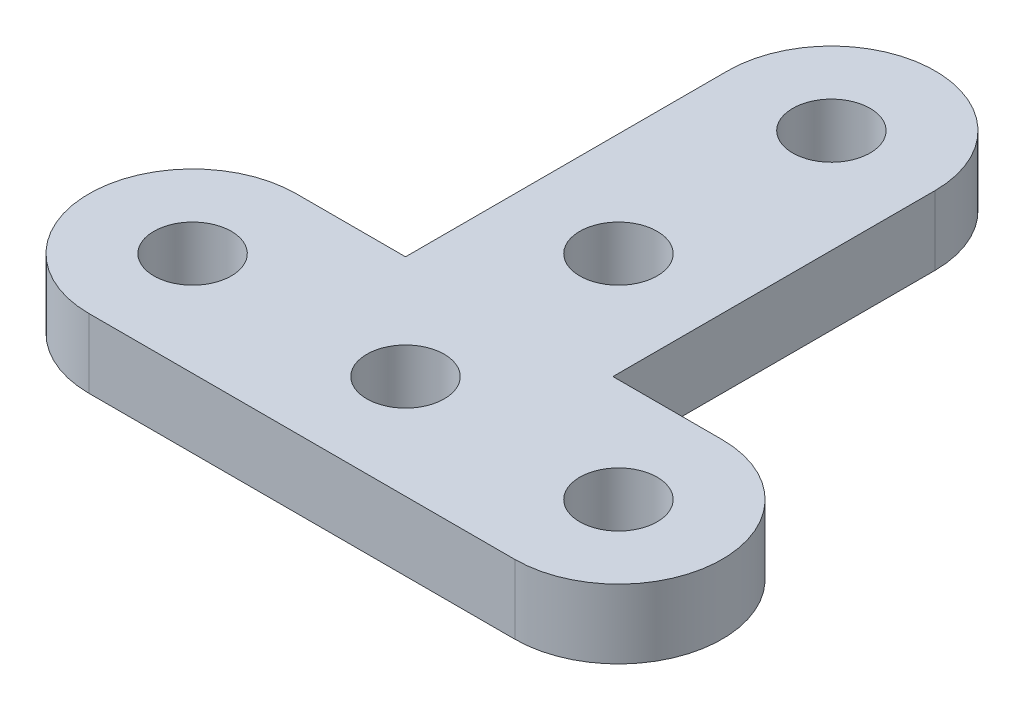
ISO-10303-21;
HEADER;
FILE_DESCRIPTION(('STEP AP214'),'2;1');
FILE_NAME('part.step','',(''),(''),'','','');
FILE_SCHEMA(('AUTOMOTIVE_DESIGN { 1 0 10303 214 1 1 1 1 }'));
ENDSEC;
DATA;
#1=APPLICATION_CONTEXT('core data for automotive mechanical design processes');
#2=APPLICATION_PROTOCOL_DEFINITION('international standard','automotive_design',2000,#1);
#3=PRODUCT_CONTEXT('',#1,'mechanical');
#4=PRODUCT('Part','Part','',(#3));
#5=PRODUCT_RELATED_PRODUCT_CATEGORY('part','',(#4));
#6=PRODUCT_DEFINITION_FORMATION('','',#4);
#7=PRODUCT_DEFINITION_CONTEXT('part definition',#1,'design');
#8=PRODUCT_DEFINITION('design','',#6,#7);
#9=PRODUCT_DEFINITION_SHAPE('','',#8);
#10=(LENGTH_UNIT() NAMED_UNIT(*) SI_UNIT(.MILLI.,.METRE.));
#11=(NAMED_UNIT(*) PLANE_ANGLE_UNIT() SI_UNIT($,.RADIAN.));
#12=(NAMED_UNIT(*) SI_UNIT($,.STERADIAN.) SOLID_ANGLE_UNIT());
#13=UNCERTAINTY_MEASURE_WITH_UNIT(LENGTH_MEASURE(1.E-05),#10,'distance_accuracy_value','');
#14=(GEOMETRIC_REPRESENTATION_CONTEXT(3) GLOBAL_UNCERTAINTY_ASSIGNED_CONTEXT((#13)) GLOBAL_UNIT_ASSIGNED_CONTEXT((#10,
#11,#12)) REPRESENTATION_CONTEXT('',''));
#15=CARTESIAN_POINT('',(0.,0.,0.));
#16=DIRECTION('',(0.,0.,1.));
#17=DIRECTION('',(1.,0.,0.));
#18=AXIS2_PLACEMENT_3D('',#15,#16,#17);
#19=CARTESIAN_POINT('',(9.779,0.,-4.7625));
#20=DIRECTION('',(0.,0.,-1.));
#21=DIRECTION('',(-1.,0.,0.));
#22=AXIS2_PLACEMENT_3D('',#19,#20,#21);
#23=PLANE('',#22);
#24=DIRECTION('',(-1.,0.,0.));
#25=VECTOR('',#24,1.);
#26=CARTESIAN_POINT('',(9.779,3.175,-4.7625));
#27=LINE('',#26,#25);
#28=CARTESIAN_POINT('',(9.779,3.175,-4.7625));
#29=VERTEX_POINT('',#28);
#30=CARTESIAN_POINT('',(4.7625,3.175,-4.7625));
#31=VERTEX_POINT('',#30);
#32=EDGE_CURVE('E130',#29,#31,#27,.T.);
#33=ORIENTED_EDGE('',*,*,#32,.F.);
#34=DIRECTION('',(0.,1.,0.));
#35=VECTOR('',#34,1.);
#36=CARTESIAN_POINT('',(9.779,0.,-4.7625));
#37=LINE('',#36,#35);
#38=CARTESIAN_POINT('',(9.779,0.,-4.7625));
#39=VERTEX_POINT('',#38);
#40=EDGE_CURVE('E11',#39,#29,#37,.T.);
#41=ORIENTED_EDGE('',*,*,#40,.F.);
#42=DIRECTION('',(-1.,0.,0.));
#43=VECTOR('',#42,1.);
#44=CARTESIAN_POINT('',(9.779,0.,-4.7625));
#45=LINE('',#44,#43);
#46=CARTESIAN_POINT('',(4.7625,0.,-4.7625));
#47=VERTEX_POINT('',#46);
#48=EDGE_CURVE('E151',#39,#47,#45,.T.);
#49=ORIENTED_EDGE('',*,*,#48,.T.);
#50=DIRECTION('',(0.,1.,0.));
#51=VECTOR('',#50,1.);
#52=CARTESIAN_POINT('',(4.7625,0.,-4.7625));
#53=LINE('',#52,#51);
#54=EDGE_CURVE('E36',#47,#31,#53,.T.);
#55=ORIENTED_EDGE('',*,*,#54,.T.);
#56=EDGE_LOOP('',(#33,#41,#49,#55));
#57=FACE_BOUND('',#56,.T.);
#58=ADVANCED_FACE('F33',(#57),#23,.T.);
#59=CARTESIAN_POINT('',(9.779,0.,0.));
#60=DIRECTION('',(0.,1.,0.));
#61=DIRECTION('',(0.,0.,1.));
#62=AXIS2_PLACEMENT_3D('',#59,#60,#61);
#63=CYLINDRICAL_SURFACE('',#62,4.7625);
#64=CARTESIAN_POINT('',(9.779,3.175,0.));
#65=DIRECTION('',(0.,1.,0.));
#66=DIRECTION('',(0.,0.,1.));
#67=AXIS2_PLACEMENT_3D('',#64,#65,#66);
#68=CIRCLE('',#67,4.7625);
#69=CARTESIAN_POINT('',(9.779,3.175,4.7625));
#70=VERTEX_POINT('',#69);
#71=EDGE_CURVE('E149',#70,#29,#68,.T.);
#72=ORIENTED_EDGE('',*,*,#71,.F.);
#73=DIRECTION('',(0.,1.,0.));
#74=VECTOR('',#73,1.);
#75=CARTESIAN_POINT('',(9.779,0.,4.7625));
#76=LINE('',#75,#74);
#77=CARTESIAN_POINT('',(9.779,0.,4.7625));
#78=VERTEX_POINT('',#77);
#79=EDGE_CURVE('E42',#78,#70,#76,.T.);
#80=ORIENTED_EDGE('',*,*,#79,.F.);
#81=CARTESIAN_POINT('',(9.779,0.,0.));
#82=DIRECTION('',(0.,1.,0.));
#83=DIRECTION('',(0.,0.,1.));
#84=AXIS2_PLACEMENT_3D('',#81,#82,#83);
#85=CIRCLE('',#84,4.7625);
#86=EDGE_CURVE('E120',#78,#39,#85,.T.);
#87=ORIENTED_EDGE('',*,*,#86,.T.);
#88=ORIENTED_EDGE('',*,*,#40,.T.);
#89=EDGE_LOOP('',(#72,#80,#87,#88));
#90=FACE_BOUND('',#89,.T.);
#91=ADVANCED_FACE('F163',(#90),#63,.T.);
#92=CARTESIAN_POINT('',(-9.779,0.,4.7625));
#93=DIRECTION('',(0.,0.,1.));
#94=DIRECTION('',(1.,0.,0.));
#95=AXIS2_PLACEMENT_3D('',#92,#93,#94);
#96=PLANE('',#95);
#97=DIRECTION('',(1.,0.,0.));
#98=VECTOR('',#97,1.);
#99=CARTESIAN_POINT('',(-9.779,3.175,4.7625));
#100=LINE('',#99,#98);
#101=CARTESIAN_POINT('',(-9.779,3.175,4.7625));
#102=VERTEX_POINT('',#101);
#103=EDGE_CURVE('E107',#102,#70,#100,.T.);
#104=ORIENTED_EDGE('',*,*,#103,.F.);
#105=DIRECTION('',(0.,1.,0.));
#106=VECTOR('',#105,1.);
#107=CARTESIAN_POINT('',(-9.779,0.,4.7625));
#108=LINE('',#107,#106);
#109=CARTESIAN_POINT('',(-9.779,0.,4.7625));
#110=VERTEX_POINT('',#109);
#111=EDGE_CURVE('E102',#110,#102,#108,.T.);
#112=ORIENTED_EDGE('',*,*,#111,.F.);
#113=DIRECTION('',(1.,0.,0.));
#114=VECTOR('',#113,1.);
#115=CARTESIAN_POINT('',(-9.779,0.,4.7625));
#116=LINE('',#115,#114);
#117=EDGE_CURVE('E105',#110,#78,#116,.T.);
#118=ORIENTED_EDGE('',*,*,#117,.T.);
#119=ORIENTED_EDGE('',*,*,#79,.T.);
#120=EDGE_LOOP('',(#104,#112,#118,#119));
#121=FACE_BOUND('',#120,.T.);
#122=ADVANCED_FACE('F104',(#121),#96,.T.);
#123=CARTESIAN_POINT('',(-9.779,0.,0.));
#124=DIRECTION('',(0.,1.,0.));
#125=DIRECTION('',(0.,0.,1.));
#126=AXIS2_PLACEMENT_3D('',#123,#124,#125);
#127=CYLINDRICAL_SURFACE('',#126,4.7625);
#128=CARTESIAN_POINT('',(-9.779,3.175,0.));
#129=DIRECTION('',(0.,1.,0.));
#130=DIRECTION('',(0.,0.,1.));
#131=AXIS2_PLACEMENT_3D('',#128,#129,#130);
#132=CIRCLE('',#131,4.7625);
#133=CARTESIAN_POINT('',(-9.779,3.175,-4.7625));
#134=VERTEX_POINT('',#133);
#135=EDGE_CURVE('E146',#134,#102,#132,.T.);
#136=ORIENTED_EDGE('',*,*,#135,.F.);
#137=DIRECTION('',(0.,1.,0.));
#138=VECTOR('',#137,1.);
#139=CARTESIAN_POINT('',(-9.779,0.,-4.7625));
#140=LINE('',#139,#138);
#141=CARTESIAN_POINT('',(-9.779,0.,-4.7625));
#142=VERTEX_POINT('',#141);
#143=EDGE_CURVE('E112',#142,#134,#140,.T.);
#144=ORIENTED_EDGE('',*,*,#143,.F.);
#145=CARTESIAN_POINT('',(-9.779,0.,0.));
#146=DIRECTION('',(0.,1.,0.));
#147=DIRECTION('',(0.,0.,1.));
#148=AXIS2_PLACEMENT_3D('',#145,#146,#147);
#149=CIRCLE('',#148,4.7625);
#150=EDGE_CURVE('E118',#142,#110,#149,.T.);
#151=ORIENTED_EDGE('',*,*,#150,.T.);
#152=ORIENTED_EDGE('',*,*,#111,.T.);
#153=EDGE_LOOP('',(#136,#144,#151,#152));
#154=FACE_BOUND('',#153,.T.);
#155=ADVANCED_FACE('F122',(#154),#127,.T.);
#156=CARTESIAN_POINT('',(-4.7625,0.,-4.7625));
#157=DIRECTION('',(0.,0.,-1.));
#158=DIRECTION('',(-1.,0.,0.));
#159=AXIS2_PLACEMENT_3D('',#156,#157,#158);
#160=PLANE('',#159);
#161=DIRECTION('',(-1.,0.,0.));
#162=VECTOR('',#161,1.);
#163=CARTESIAN_POINT('',(-4.7625,3.175,-4.7625));
#164=LINE('',#163,#162);
#165=CARTESIAN_POINT('',(-4.7625,3.175,-4.7625));
#166=VERTEX_POINT('',#165);
#167=EDGE_CURVE('E143',#166,#134,#164,.T.);
#168=ORIENTED_EDGE('',*,*,#167,.F.);
#169=DIRECTION('',(0.,1.,0.));
#170=VECTOR('',#169,1.);
#171=CARTESIAN_POINT('',(-4.7625,0.,-4.7625));
#172=LINE('',#171,#170);
#173=CARTESIAN_POINT('',(-4.7625,0.,-4.7625));
#174=VERTEX_POINT('',#173);
#175=EDGE_CURVE('E155',#174,#166,#172,.T.);
#176=ORIENTED_EDGE('',*,*,#175,.F.);
#177=DIRECTION('',(-1.,0.,0.));
#178=VECTOR('',#177,1.);
#179=CARTESIAN_POINT('',(-4.7625,0.,-4.7625));
#180=LINE('',#179,#178);
#181=EDGE_CURVE('E123',#174,#142,#180,.T.);
#182=ORIENTED_EDGE('',*,*,#181,.T.);
#183=ORIENTED_EDGE('',*,*,#143,.T.);
#184=EDGE_LOOP('',(#168,#176,#182,#183));
#185=FACE_BOUND('',#184,.T.);
#186=ADVANCED_FACE('F176',(#185),#160,.T.);
#187=CARTESIAN_POINT('',(-4.7625,0.,-19.558));
#188=DIRECTION('',(-1.,0.,0.));
#189=DIRECTION('',(0.,0.,1.));
#190=AXIS2_PLACEMENT_3D('',#187,#188,#189);
#191=PLANE('',#190);
#192=DIRECTION('',(0.,0.,1.));
#193=VECTOR('',#192,1.);
#194=CARTESIAN_POINT('',(-4.7625,3.175,-19.558));
#195=LINE('',#194,#193);
#196=CARTESIAN_POINT('',(-4.7625,3.175,-19.558));
#197=VERTEX_POINT('',#196);
#198=EDGE_CURVE('E140',#197,#166,#195,.T.);
#199=ORIENTED_EDGE('',*,*,#198,.F.);
#200=DIRECTION('',(0.,1.,0.));
#201=VECTOR('',#200,1.);
#202=CARTESIAN_POINT('',(-4.7625,0.,-19.558));
#203=LINE('',#202,#201);
#204=CARTESIAN_POINT('',(-4.7625,0.,-19.558));
#205=VERTEX_POINT('',#204);
#206=EDGE_CURVE('E157',#205,#197,#203,.T.);
#207=ORIENTED_EDGE('',*,*,#206,.F.);
#208=DIRECTION('',(0.,0.,1.));
#209=VECTOR('',#208,1.);
#210=CARTESIAN_POINT('',(-4.7625,0.,-19.558));
#211=LINE('',#210,#209);
#212=EDGE_CURVE('E125',#205,#174,#211,.T.);
#213=ORIENTED_EDGE('',*,*,#212,.T.);
#214=ORIENTED_EDGE('',*,*,#175,.T.);
#215=EDGE_LOOP('',(#199,#207,#213,#214));
#216=FACE_BOUND('',#215,.T.);
#217=ADVANCED_FACE('F179',(#216),#191,.T.);
#218=CARTESIAN_POINT('',(0.,0.,-19.558));
#219=DIRECTION('',(0.,1.,0.));
#220=DIRECTION('',(0.,0.,1.));
#221=AXIS2_PLACEMENT_3D('',#218,#219,#220);
#222=CYLINDRICAL_SURFACE('',#221,4.7625);
#223=CARTESIAN_POINT('',(0.,3.175,-19.558));
#224=DIRECTION('',(0.,1.,0.));
#225=DIRECTION('',(0.,0.,1.));
#226=AXIS2_PLACEMENT_3D('',#223,#224,#225);
#227=CIRCLE('',#226,4.7625);
#228=CARTESIAN_POINT('',(4.7625,3.175,-19.558));
#229=VERTEX_POINT('',#228);
#230=EDGE_CURVE('E137',#229,#197,#227,.T.);
#231=ORIENTED_EDGE('',*,*,#230,.F.);
#232=DIRECTION('',(0.,1.,0.));
#233=VECTOR('',#232,1.);
#234=CARTESIAN_POINT('',(4.7625,0.,-19.558));
#235=LINE('',#234,#233);
#236=CARTESIAN_POINT('',(4.7625,0.,-19.558));
#237=VERTEX_POINT('',#236);
#238=EDGE_CURVE('E158',#237,#229,#235,.T.);
#239=ORIENTED_EDGE('',*,*,#238,.F.);
#240=CARTESIAN_POINT('',(0.,0.,-19.558));
#241=DIRECTION('',(0.,1.,0.));
#242=DIRECTION('',(0.,0.,1.));
#243=AXIS2_PLACEMENT_3D('',#240,#241,#242);
#244=CIRCLE('',#243,4.7625);
#245=EDGE_CURVE('E255',#237,#205,#244,.T.);
#246=ORIENTED_EDGE('',*,*,#245,.T.);
#247=ORIENTED_EDGE('',*,*,#206,.T.);
#248=EDGE_LOOP('',(#231,#239,#246,#247));
#249=FACE_BOUND('',#248,.T.);
#250=ADVANCED_FACE('F183',(#249),#222,.T.);
#251=CARTESIAN_POINT('',(4.7625,0.,-4.7625));
#252=DIRECTION('',(1.,0.,0.));
#253=DIRECTION('',(0.,0.,-1.));
#254=AXIS2_PLACEMENT_3D('',#251,#252,#253);
#255=PLANE('',#254);
#256=DIRECTION('',(0.,0.,-1.));
#257=VECTOR('',#256,1.);
#258=CARTESIAN_POINT('',(4.7625,3.175,-4.7625));
#259=LINE('',#258,#257);
#260=EDGE_CURVE('E133',#31,#229,#259,.T.);
#261=ORIENTED_EDGE('',*,*,#260,.F.);
#262=ORIENTED_EDGE('',*,*,#54,.F.);
#263=DIRECTION('',(0.,0.,-1.));
#264=VECTOR('',#263,1.);
#265=CARTESIAN_POINT('',(4.7625,0.,-4.7625));
#266=LINE('',#265,#264);
#267=EDGE_CURVE('E253',#47,#237,#266,.T.);
#268=ORIENTED_EDGE('',*,*,#267,.T.);
#269=ORIENTED_EDGE('',*,*,#238,.T.);
#270=EDGE_LOOP('',(#261,#262,#268,#269));
#271=FACE_BOUND('',#270,.T.);
#272=ADVANCED_FACE('F160',(#271),#255,.T.);
#273=CARTESIAN_POINT('',(0.,0.,-19.558));
#274=DIRECTION('',(0.,1.,0.));
#275=DIRECTION('',(0.,0.,1.));
#276=AXIS2_PLACEMENT_3D('',#273,#274,#275);
#277=PLANE('',#276);
#278=CARTESIAN_POINT('',(0.,0.,0.));
#279=DIRECTION('',(0.,1.,0.));
#280=DIRECTION('',(0.,0.,-1.));
#281=AXIS2_PLACEMENT_3D('',#278,#279,#280);
#282=CIRCLE('',#281,1.77799999999999);
#283=CARTESIAN_POINT('',(0.,0.,-1.77799999999999));
#284=VERTEX_POINT('',#283);
#285=EDGE_CURVE('E222',#284,#284,#282,.T.);
#286=ORIENTED_EDGE('',*,*,#285,.T.);
#287=EDGE_LOOP('',(#286));
#288=FACE_BOUND('',#287,.T.);
#289=CARTESIAN_POINT('',(-9.779,0.,0.));
#290=DIRECTION('',(0.,1.,0.));
#291=DIRECTION('',(0.,0.,-1.));
#292=AXIS2_PLACEMENT_3D('',#289,#290,#291);
#293=CIRCLE('',#292,1.77799999999999);
#294=CARTESIAN_POINT('',(-9.779,0.,-1.77799999999999));
#295=VERTEX_POINT('',#294);
#296=EDGE_CURVE('E230',#295,#295,#293,.T.);
#297=ORIENTED_EDGE('',*,*,#296,.T.);
#298=EDGE_LOOP('',(#297));
#299=FACE_BOUND('',#298,.T.);
#300=CARTESIAN_POINT('',(0.,0.,-9.77899999999998));
#301=DIRECTION('',(0.,1.,0.));
#302=DIRECTION('',(0.,0.,-1.));
#303=AXIS2_PLACEMENT_3D('',#300,#301,#302);
#304=CIRCLE('',#303,1.77799999999999);
#305=CARTESIAN_POINT('',(0.,0.,-11.557));
#306=VERTEX_POINT('',#305);
#307=EDGE_CURVE('E236',#306,#306,#304,.T.);
#308=ORIENTED_EDGE('',*,*,#307,.T.);
#309=EDGE_LOOP('',(#308));
#310=FACE_BOUND('',#309,.T.);
#311=CARTESIAN_POINT('',(9.779,0.,0.));
#312=DIRECTION('',(0.,1.,0.));
#313=DIRECTION('',(0.,0.,-1.));
#314=AXIS2_PLACEMENT_3D('',#311,#312,#313);
#315=CIRCLE('',#314,1.77799999999999);
#316=CARTESIAN_POINT('',(9.779,0.,-1.77799999999999));
#317=VERTEX_POINT('',#316);
#318=EDGE_CURVE('E242',#317,#317,#315,.T.);
#319=ORIENTED_EDGE('',*,*,#318,.T.);
#320=EDGE_LOOP('',(#319));
#321=FACE_BOUND('',#320,.T.);
#322=CARTESIAN_POINT('',(0.,0.,-19.558));
#323=DIRECTION('',(0.,1.,0.));
#324=DIRECTION('',(0.,0.,-1.));
#325=AXIS2_PLACEMENT_3D('',#322,#323,#324);
#326=CIRCLE('',#325,1.77799999999999);
#327=CARTESIAN_POINT('',(0.,0.,-21.336));
#328=VERTEX_POINT('',#327);
#329=EDGE_CURVE('E134',#328,#328,#326,.T.);
#330=ORIENTED_EDGE('',*,*,#329,.T.);
#331=EDGE_LOOP('',(#330));
#332=FACE_BOUND('',#331,.T.);
#333=ORIENTED_EDGE('',*,*,#48,.F.);
#334=ORIENTED_EDGE('',*,*,#86,.F.);
#335=ORIENTED_EDGE('',*,*,#117,.F.);
#336=ORIENTED_EDGE('',*,*,#150,.F.);
#337=ORIENTED_EDGE('',*,*,#181,.F.);
#338=ORIENTED_EDGE('',*,*,#212,.F.);
#339=ORIENTED_EDGE('',*,*,#245,.F.);
#340=ORIENTED_EDGE('',*,*,#267,.F.);
#341=EDGE_LOOP('',(#333,#334,#335,#336,#337,#338,#339,#340));
#342=FACE_BOUND('',#341,.T.);
#343=ADVANCED_FACE('F116',(#288,#299,#310,#321,#332,#342),#277,.F.);
#344=CARTESIAN_POINT('',(0.,3.175,-19.558));
#345=DIRECTION('',(0.,1.,0.));
#346=DIRECTION('',(0.,0.,1.));
#347=AXIS2_PLACEMENT_3D('',#344,#345,#346);
#348=PLANE('',#347);
#349=CARTESIAN_POINT('',(0.,3.175,0.));
#350=DIRECTION('',(0.,1.,0.));
#351=DIRECTION('',(0.,0.,-1.));
#352=AXIS2_PLACEMENT_3D('',#349,#350,#351);
#353=CIRCLE('',#352,1.77799999999999);
#354=CARTESIAN_POINT('',(0.,3.175,-1.77799999999999));
#355=VERTEX_POINT('',#354);
#356=EDGE_CURVE('E225',#355,#355,#353,.T.);
#357=ORIENTED_EDGE('',*,*,#356,.F.);
#358=EDGE_LOOP('',(#357));
#359=FACE_BOUND('',#358,.T.);
#360=CARTESIAN_POINT('',(-9.779,3.175,0.));
#361=DIRECTION('',(0.,1.,0.));
#362=DIRECTION('',(0.,0.,-1.));
#363=AXIS2_PLACEMENT_3D('',#360,#361,#362);
#364=CIRCLE('',#363,1.77799999999999);
#365=CARTESIAN_POINT('',(-9.779,3.175,-1.77799999999999));
#366=VERTEX_POINT('',#365);
#367=EDGE_CURVE('E227',#366,#366,#364,.T.);
#368=ORIENTED_EDGE('',*,*,#367,.F.);
#369=EDGE_LOOP('',(#368));
#370=FACE_BOUND('',#369,.T.);
#371=CARTESIAN_POINT('',(0.,3.175,-9.77899999999998));
#372=DIRECTION('',(0.,1.,0.));
#373=DIRECTION('',(0.,0.,-1.));
#374=AXIS2_PLACEMENT_3D('',#371,#372,#373);
#375=CIRCLE('',#374,1.77799999999999);
#376=CARTESIAN_POINT('',(0.,3.175,-11.557));
#377=VERTEX_POINT('',#376);
#378=EDGE_CURVE('E233',#377,#377,#375,.T.);
#379=ORIENTED_EDGE('',*,*,#378,.F.);
#380=EDGE_LOOP('',(#379));
#381=FACE_BOUND('',#380,.T.);
#382=CARTESIAN_POINT('',(9.779,3.175,0.));
#383=DIRECTION('',(0.,1.,0.));
#384=DIRECTION('',(0.,0.,-1.));
#385=AXIS2_PLACEMENT_3D('',#382,#383,#384);
#386=CIRCLE('',#385,1.77799999999999);
#387=CARTESIAN_POINT('',(9.779,3.175,-1.77799999999999));
#388=VERTEX_POINT('',#387);
#389=EDGE_CURVE('E239',#388,#388,#386,.T.);
#390=ORIENTED_EDGE('',*,*,#389,.F.);
#391=EDGE_LOOP('',(#390));
#392=FACE_BOUND('',#391,.T.);
#393=CARTESIAN_POINT('',(0.,3.175,-19.558));
#394=DIRECTION('',(0.,1.,0.));
#395=DIRECTION('',(0.,0.,-1.));
#396=AXIS2_PLACEMENT_3D('',#393,#394,#395);
#397=CIRCLE('',#396,1.77799999999999);
#398=CARTESIAN_POINT('',(0.,3.175,-21.336));
#399=VERTEX_POINT('',#398);
#400=EDGE_CURVE('E245',#399,#399,#397,.T.);
#401=ORIENTED_EDGE('',*,*,#400,.F.);
#402=EDGE_LOOP('',(#401));
#403=FACE_BOUND('',#402,.T.);
#404=ORIENTED_EDGE('',*,*,#32,.T.);
#405=ORIENTED_EDGE('',*,*,#260,.T.);
#406=ORIENTED_EDGE('',*,*,#230,.T.);
#407=ORIENTED_EDGE('',*,*,#198,.T.);
#408=ORIENTED_EDGE('',*,*,#167,.T.);
#409=ORIENTED_EDGE('',*,*,#135,.T.);
#410=ORIENTED_EDGE('',*,*,#103,.T.);
#411=ORIENTED_EDGE('',*,*,#71,.T.);
#412=EDGE_LOOP('',(#404,#405,#406,#407,#408,#409,#410,#411));
#413=FACE_BOUND('',#412,.T.);
#414=ADVANCED_FACE('F162',(#359,#370,#381,#392,#403,#413),#348,.T.);
#415=CARTESIAN_POINT('',(0.,0.,-19.558));
#416=DIRECTION('',(0.,1.,0.));
#417=DIRECTION('',(0.,0.,1.));
#418=AXIS2_PLACEMENT_3D('',#415,#416,#417);
#419=CYLINDRICAL_SURFACE('',#418,1.77799999999999);
#420=ORIENTED_EDGE('',*,*,#329,.F.);
#421=EDGE_LOOP('',(#420));
#422=FACE_BOUND('',#421,.T.);
#423=ORIENTED_EDGE('',*,*,#400,.T.);
#424=EDGE_LOOP('',(#423));
#425=FACE_BOUND('',#424,.T.);
#426=ADVANCED_FACE('F195',(#422,#425),#419,.F.);
#427=CARTESIAN_POINT('',(9.779,0.,0.));
#428=DIRECTION('',(0.,1.,0.));
#429=DIRECTION('',(0.,0.,1.));
#430=AXIS2_PLACEMENT_3D('',#427,#428,#429);
#431=CYLINDRICAL_SURFACE('',#430,1.77799999999999);
#432=ORIENTED_EDGE('',*,*,#318,.F.);
#433=EDGE_LOOP('',(#432));
#434=FACE_BOUND('',#433,.T.);
#435=ORIENTED_EDGE('',*,*,#389,.T.);
#436=EDGE_LOOP('',(#435));
#437=FACE_BOUND('',#436,.T.);
#438=ADVANCED_FACE('F202',(#434,#437),#431,.F.);
#439=CARTESIAN_POINT('',(0.,0.,-9.77899999999998));
#440=DIRECTION('',(0.,1.,0.));
#441=DIRECTION('',(0.,0.,1.));
#442=AXIS2_PLACEMENT_3D('',#439,#440,#441);
#443=CYLINDRICAL_SURFACE('',#442,1.77799999999999);
#444=ORIENTED_EDGE('',*,*,#307,.F.);
#445=EDGE_LOOP('',(#444));
#446=FACE_BOUND('',#445,.T.);
#447=ORIENTED_EDGE('',*,*,#378,.T.);
#448=EDGE_LOOP('',(#447));
#449=FACE_BOUND('',#448,.T.);
#450=ADVANCED_FACE('F206',(#446,#449),#443,.F.);
#451=CARTESIAN_POINT('',(-9.779,0.,0.));
#452=DIRECTION('',(0.,1.,0.));
#453=DIRECTION('',(0.,0.,1.));
#454=AXIS2_PLACEMENT_3D('',#451,#452,#453);
#455=CYLINDRICAL_SURFACE('',#454,1.77799999999999);
#456=ORIENTED_EDGE('',*,*,#296,.F.);
#457=EDGE_LOOP('',(#456));
#458=FACE_BOUND('',#457,.T.);
#459=ORIENTED_EDGE('',*,*,#367,.T.);
#460=EDGE_LOOP('',(#459));
#461=FACE_BOUND('',#460,.T.);
#462=ADVANCED_FACE('F210',(#458,#461),#455,.F.);
#463=CARTESIAN_POINT('',(0.,0.,0.));
#464=DIRECTION('',(0.,1.,0.));
#465=DIRECTION('',(0.,0.,1.));
#466=AXIS2_PLACEMENT_3D('',#463,#464,#465);
#467=CYLINDRICAL_SURFACE('',#466,1.77799999999999);
#468=ORIENTED_EDGE('',*,*,#285,.F.);
#469=EDGE_LOOP('',(#468));
#470=FACE_BOUND('',#469,.T.);
#471=ORIENTED_EDGE('',*,*,#356,.T.);
#472=EDGE_LOOP('',(#471));
#473=FACE_BOUND('',#472,.T.);
#474=ADVANCED_FACE('F214',(#470,#473),#467,.F.);
#475=CLOSED_SHELL('',(#58,#91,#122,#155,#186,#217,#250,#272,#343,#414,#426,#438,#450,#462,#474));
#476=MANIFOLD_SOLID_BREP('B2',#475);
#477=ADVANCED_BREP_SHAPE_REPRESENTATION('',(#18,#476),#14);
#478=SHAPE_DEFINITION_REPRESENTATION(#9,#477);
ENDSEC;
END-ISO-10303-21;
